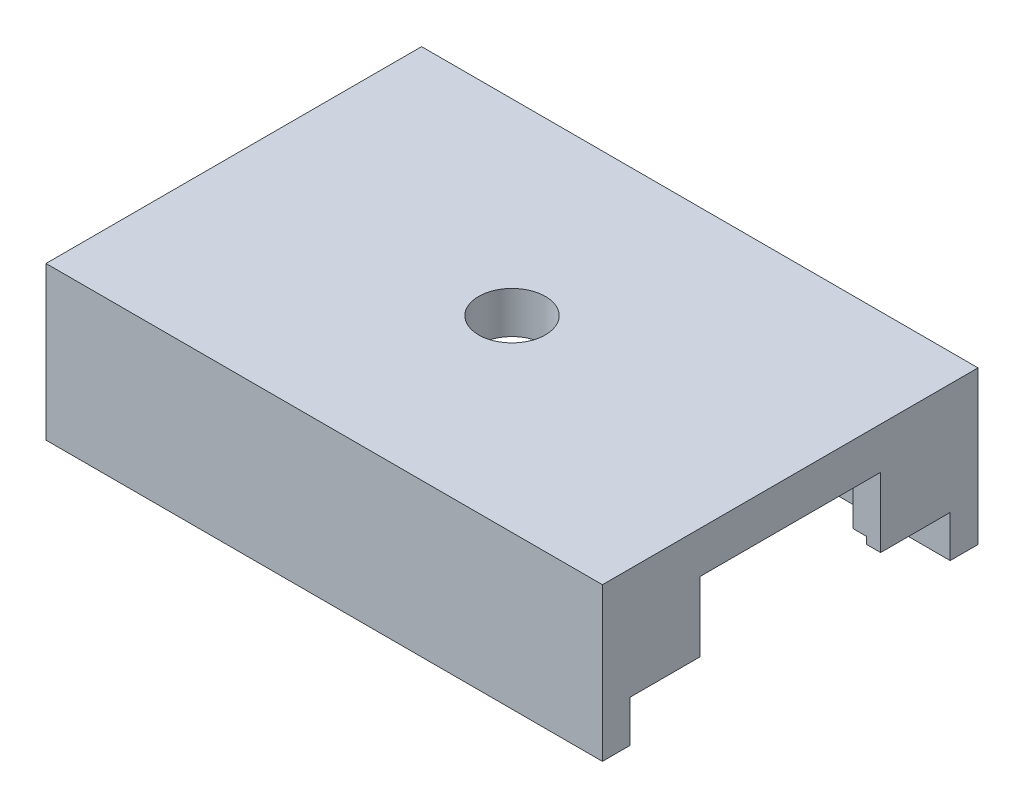
ISO-10303-21;
HEADER;
FILE_DESCRIPTION(('STEP AP214'),'2;1');
FILE_NAME('part.step','',(''),(''),'','','');
FILE_SCHEMA(('AUTOMOTIVE_DESIGN { 1 0 10303 214 1 1 1 1 }'));
ENDSEC;
DATA;
#1=APPLICATION_CONTEXT('core data for automotive mechanical design processes');
#2=APPLICATION_PROTOCOL_DEFINITION('international standard','automotive_design',2000,#1);
#3=PRODUCT_CONTEXT('',#1,'mechanical');
#4=PRODUCT('Part','Part','',(#3));
#5=PRODUCT_RELATED_PRODUCT_CATEGORY('part','',(#4));
#6=PRODUCT_DEFINITION_FORMATION('','',#4);
#7=PRODUCT_DEFINITION_CONTEXT('part definition',#1,'design');
#8=PRODUCT_DEFINITION('design','',#6,#7);
#9=PRODUCT_DEFINITION_SHAPE('','',#8);
#10=(LENGTH_UNIT() NAMED_UNIT(*) SI_UNIT(.MILLI.,.METRE.));
#11=(NAMED_UNIT(*) PLANE_ANGLE_UNIT() SI_UNIT($,.RADIAN.));
#12=(NAMED_UNIT(*) SI_UNIT($,.STERADIAN.) SOLID_ANGLE_UNIT());
#13=UNCERTAINTY_MEASURE_WITH_UNIT(LENGTH_MEASURE(1.E-05),#10,'distance_accuracy_value','');
#14=(GEOMETRIC_REPRESENTATION_CONTEXT(3) GLOBAL_UNCERTAINTY_ASSIGNED_CONTEXT((#13)) GLOBAL_UNIT_ASSIGNED_CONTEXT((#10,
#11,#12)) REPRESENTATION_CONTEXT('',''));
#15=CARTESIAN_POINT('',(0.,0.,0.));
#16=DIRECTION('',(0.,0.,1.));
#17=DIRECTION('',(1.,0.,0.));
#18=AXIS2_PLACEMENT_3D('',#15,#16,#17);
#19=CARTESIAN_POINT('',(0.,-11.,11.5));
#20=DIRECTION('',(0.,0.,-1.));
#21=DIRECTION('',(-1.,0.,0.));
#22=AXIS2_PLACEMENT_3D('',#19,#20,#21);
#23=PLANE('',#22);
#24=DIRECTION('',(-1.,0.,0.));
#25=VECTOR('',#24,1.);
#26=CARTESIAN_POINT('',(-20.,-8.,11.5));
#27=LINE('',#26,#25);
#28=CARTESIAN_POINT('',(-19.,-8.,11.5));
#29=VERTEX_POINT('',#28);
#30=CARTESIAN_POINT('',(-20.,-8.,11.5));
#31=VERTEX_POINT('',#30);
#32=EDGE_CURVE('E278',#29,#31,#27,.T.);
#33=ORIENTED_EDGE('',*,*,#32,.F.);
#34=DIRECTION('',(0.,-1.,0.));
#35=VECTOR('',#34,1.);
#36=CARTESIAN_POINT('',(-19.,0.,11.5));
#37=LINE('',#36,#35);
#38=CARTESIAN_POINT('',(-19.,-8.5,11.5));
#39=VERTEX_POINT('',#38);
#40=EDGE_CURVE('E59',#29,#39,#37,.T.);
#41=ORIENTED_EDGE('',*,*,#40,.T.);
#42=DIRECTION('',(-1.,0.,0.));
#43=VECTOR('',#42,1.);
#44=CARTESIAN_POINT('',(0.,-8.5,11.5));
#45=LINE('',#44,#43);
#46=CARTESIAN_POINT('',(19.,-8.5,11.5));
#47=VERTEX_POINT('',#46);
#48=EDGE_CURVE('E599',#47,#39,#45,.T.);
#49=ORIENTED_EDGE('',*,*,#48,.F.);
#50=DIRECTION('',(0.,-1.,0.));
#51=VECTOR('',#50,1.);
#52=CARTESIAN_POINT('',(19.,0.,11.5));
#53=LINE('',#52,#51);
#54=CARTESIAN_POINT('',(19.,-8.,11.5));
#55=VERTEX_POINT('',#54);
#56=EDGE_CURVE('E615',#55,#47,#53,.T.);
#57=ORIENTED_EDGE('',*,*,#56,.F.);
#58=DIRECTION('',(-1.,0.,0.));
#59=VECTOR('',#58,1.);
#60=CARTESIAN_POINT('',(20.,-8.,11.5));
#61=LINE('',#60,#59);
#62=CARTESIAN_POINT('',(20.,-8.,11.5));
#63=VERTEX_POINT('',#62);
#64=EDGE_CURVE('E365',#63,#55,#61,.T.);
#65=ORIENTED_EDGE('',*,*,#64,.F.);
#66=DIRECTION('',(0.,1.,0.));
#67=VECTOR('',#66,1.);
#68=CARTESIAN_POINT('',(20.,-11.,11.5));
#69=LINE('',#68,#67);
#70=CARTESIAN_POINT('',(20.,-11.,11.5));
#71=VERTEX_POINT('',#70);
#72=EDGE_CURVE('E415',#71,#63,#69,.T.);
#73=ORIENTED_EDGE('',*,*,#72,.F.);
#74=DIRECTION('',(-1.,0.,0.));
#75=VECTOR('',#74,1.);
#76=CARTESIAN_POINT('',(0.,-11.,11.5));
#77=LINE('',#76,#75);
#78=CARTESIAN_POINT('',(-20.,-11.,11.5));
#79=VERTEX_POINT('',#78);
#80=EDGE_CURVE('E389',#71,#79,#77,.T.);
#81=ORIENTED_EDGE('',*,*,#80,.T.);
#82=DIRECTION('',(0.,1.,0.));
#83=VECTOR('',#82,1.);
#84=CARTESIAN_POINT('',(-20.,-11.,11.5));
#85=LINE('',#84,#83);
#86=EDGE_CURVE('E402',#79,#31,#85,.T.);
#87=ORIENTED_EDGE('',*,*,#86,.T.);
#88=EDGE_LOOP('',(#33,#41,#49,#57,#65,#73,#81,#87));
#89=FACE_BOUND('',#88,.T.);
#90=ADVANCED_FACE('F41',(#89),#23,.T.);
#91=DIRECTION('',(0.,1.,0.));
#92=VECTOR('',#91,1.);
#93=CARTESIAN_POINT('',(18.,-8.,11.5));
#94=LINE('',#93,#92);
#95=CARTESIAN_POINT('',(18.,-7.5,11.5));
#96=VERTEX_POINT('',#95);
#97=CARTESIAN_POINT('',(18.,-3.,11.5));
#98=VERTEX_POINT('',#97);
#99=EDGE_CURVE('E385',#96,#98,#94,.T.);
#100=ORIENTED_EDGE('',*,*,#99,.F.);
#101=DIRECTION('',(-1.,0.,0.));
#102=VECTOR('',#101,1.);
#103=CARTESIAN_POINT('',(0.,-7.5,11.5));
#104=LINE('',#103,#102);
#105=CARTESIAN_POINT('',(-18.,-7.5,11.5));
#106=VERTEX_POINT('',#105);
#107=EDGE_CURVE('E575',#96,#106,#104,.T.);
#108=ORIENTED_EDGE('',*,*,#107,.T.);
#109=DIRECTION('',(0.,1.,0.));
#110=VECTOR('',#109,1.);
#111=CARTESIAN_POINT('',(-18.,-8.,11.5));
#112=LINE('',#111,#110);
#113=CARTESIAN_POINT('',(-18.,-3.,11.5));
#114=VERTEX_POINT('',#113);
#115=EDGE_CURVE('E282',#106,#114,#112,.T.);
#116=ORIENTED_EDGE('',*,*,#115,.T.);
#117=DIRECTION('',(-1.,0.,0.));
#118=VECTOR('',#117,1.);
#119=CARTESIAN_POINT('',(0.,-3.,11.5));
#120=LINE('',#119,#118);
#121=EDGE_CURVE('E388',#98,#114,#120,.T.);
#122=ORIENTED_EDGE('',*,*,#121,.F.);
#123=EDGE_LOOP('',(#100,#108,#116,#122));
#124=FACE_BOUND('',#123,.T.);
#125=ADVANCED_FACE('F488',(#124),#23,.T.);
#126=CARTESIAN_POINT('',(18.,-8.,11.5));
#127=DIRECTION('',(1.,0.,0.));
#128=DIRECTION('',(0.,0.,-1.));
#129=AXIS2_PLACEMENT_3D('',#126,#127,#128);
#130=PLANE('',#129);
#131=DIRECTION('',(0.,0.,-1.));
#132=VECTOR('',#131,1.);
#133=CARTESIAN_POINT('',(18.,-7.5,-13.501));
#134=LINE('',#133,#132);
#135=CARTESIAN_POINT('',(18.,-7.5,6.5));
#136=VERTEX_POINT('',#135);
#137=EDGE_CURVE('E573',#96,#136,#134,.T.);
#138=ORIENTED_EDGE('',*,*,#137,.F.);
#139=ORIENTED_EDGE('',*,*,#99,.T.);
#140=DIRECTION('',(0.,0.,-1.));
#141=VECTOR('',#140,1.);
#142=CARTESIAN_POINT('',(18.,-3.,11.5));
#143=LINE('',#142,#141);
#144=CARTESIAN_POINT('',(18.,-3.,6.5));
#145=VERTEX_POINT('',#144);
#146=EDGE_CURVE('E361',#98,#145,#143,.T.);
#147=ORIENTED_EDGE('',*,*,#146,.T.);
#148=DIRECTION('',(0.,1.,0.));
#149=VECTOR('',#148,1.);
#150=CARTESIAN_POINT('',(18.,-8.,6.5));
#151=LINE('',#150,#149);
#152=EDGE_CURVE('E382',#136,#145,#151,.T.);
#153=ORIENTED_EDGE('',*,*,#152,.F.);
#154=EDGE_LOOP('',(#138,#139,#147,#153));
#155=FACE_BOUND('',#154,.T.);
#156=ADVANCED_FACE('F494',(#155),#130,.F.);
#157=CARTESIAN_POINT('',(-20.,-8.,6.5));
#158=DIRECTION('',(0.,0.,1.));
#159=DIRECTION('',(1.,0.,0.));
#160=AXIS2_PLACEMENT_3D('',#157,#158,#159);
#161=PLANE('',#160);
#162=DIRECTION('',(0.,1.,0.));
#163=VECTOR('',#162,1.);
#164=CARTESIAN_POINT('',(-19.,0.,6.5));
#165=LINE('',#164,#163);
#166=CARTESIAN_POINT('',(-19.,-8.,6.5));
#167=VERTEX_POINT('',#166);
#168=CARTESIAN_POINT('',(-19.,-7.5,6.5));
#169=VERTEX_POINT('',#168);
#170=EDGE_CURVE('E255',#167,#169,#165,.T.);
#171=ORIENTED_EDGE('',*,*,#170,.F.);
#172=DIRECTION('',(1.,0.,0.));
#173=VECTOR('',#172,1.);
#174=CARTESIAN_POINT('',(-20.,-8.,6.5));
#175=LINE('',#174,#173);
#176=CARTESIAN_POINT('',(-20.,-8.,6.5));
#177=VERTEX_POINT('',#176);
#178=EDGE_CURVE('E267',#177,#167,#175,.T.);
#179=ORIENTED_EDGE('',*,*,#178,.F.);
#180=DIRECTION('',(0.,1.,0.));
#181=VECTOR('',#180,1.);
#182=CARTESIAN_POINT('',(-20.,-8.,6.5));
#183=LINE('',#182,#181);
#184=CARTESIAN_POINT('',(-20.,-3.,6.5));
#185=VERTEX_POINT('',#184);
#186=EDGE_CURVE('E301',#177,#185,#183,.T.);
#187=ORIENTED_EDGE('',*,*,#186,.T.);
#188=DIRECTION('',(1.,0.,0.));
#189=VECTOR('',#188,1.);
#190=CARTESIAN_POINT('',(-20.,-3.,6.5));
#191=LINE('',#190,#189);
#192=CARTESIAN_POINT('',(-18.,-3.,6.5));
#193=VERTEX_POINT('',#192);
#194=EDGE_CURVE('E288',#185,#193,#191,.T.);
#195=ORIENTED_EDGE('',*,*,#194,.T.);
#196=DIRECTION('',(0.,1.,0.));
#197=VECTOR('',#196,1.);
#198=CARTESIAN_POINT('',(-18.,-8.,6.5));
#199=LINE('',#198,#197);
#200=CARTESIAN_POINT('',(-18.,-7.5,6.5));
#201=VERTEX_POINT('',#200);
#202=EDGE_CURVE('E298',#201,#193,#199,.T.);
#203=ORIENTED_EDGE('',*,*,#202,.F.);
#204=DIRECTION('',(1.,0.,0.));
#205=VECTOR('',#204,1.);
#206=CARTESIAN_POINT('',(0.,-7.5,6.49999999999999));
#207=LINE('',#206,#205);
#208=EDGE_CURVE('E262',#169,#201,#207,.T.);
#209=ORIENTED_EDGE('',*,*,#208,.F.);
#210=EDGE_LOOP('',(#171,#179,#187,#195,#203,#209));
#211=FACE_BOUND('',#210,.T.);
#212=ADVANCED_FACE('F265',(#211),#161,.F.);
#213=CARTESIAN_POINT('',(-18.,-8.,11.5));
#214=DIRECTION('',(-1.,0.,0.));
#215=DIRECTION('',(0.,0.,1.));
#216=AXIS2_PLACEMENT_3D('',#213,#214,#215);
#217=PLANE('',#216);
#218=DIRECTION('',(0.,0.,1.));
#219=VECTOR('',#218,1.);
#220=CARTESIAN_POINT('',(-18.,-7.5,-13.501));
#221=LINE('',#220,#219);
#222=EDGE_CURVE('E271',#201,#106,#221,.T.);
#223=ORIENTED_EDGE('',*,*,#222,.F.);
#224=ORIENTED_EDGE('',*,*,#202,.T.);
#225=DIRECTION('',(0.,0.,1.));
#226=VECTOR('',#225,1.);
#227=CARTESIAN_POINT('',(-18.,-3.,11.5));
#228=LINE('',#227,#226);
#229=EDGE_CURVE('E284',#193,#114,#228,.T.);
#230=ORIENTED_EDGE('',*,*,#229,.T.);
#231=ORIENTED_EDGE('',*,*,#115,.F.);
#232=EDGE_LOOP('',(#223,#224,#230,#231));
#233=FACE_BOUND('',#232,.T.);
#234=ADVANCED_FACE('F579',(#233),#217,.F.);
#235=CARTESIAN_POINT('',(0.,-8.,0.));
#236=DIRECTION('',(0.,-1.,0.));
#237=DIRECTION('',(0.,0.,-1.));
#238=AXIS2_PLACEMENT_3D('',#235,#236,#237);
#239=PLANE('',#238);
#240=ORIENTED_EDGE('',*,*,#178,.T.);
#241=DIRECTION('',(0.,0.,1.));
#242=VECTOR('',#241,1.);
#243=CARTESIAN_POINT('',(-19.,-8.,-13.501));
#244=LINE('',#243,#242);
#245=EDGE_CURVE('E251',#167,#29,#244,.T.);
#246=ORIENTED_EDGE('',*,*,#245,.T.);
#247=ORIENTED_EDGE('',*,*,#32,.T.);
#248=DIRECTION('',(0.,0.,-1.));
#249=VECTOR('',#248,1.);
#250=CARTESIAN_POINT('',(-20.,-8.,11.5));
#251=LINE('',#250,#249);
#252=EDGE_CURVE('E275',#31,#177,#251,.T.);
#253=ORIENTED_EDGE('',*,*,#252,.T.);
#254=EDGE_LOOP('',(#240,#246,#247,#253));
#255=FACE_BOUND('',#254,.T.);
#256=ADVANCED_FACE('F273',(#255),#239,.T.);
#257=CARTESIAN_POINT('',(0.,-11.,-11.5));
#258=DIRECTION('',(0.,0.,-1.));
#259=DIRECTION('',(-1.,0.,0.));
#260=AXIS2_PLACEMENT_3D('',#257,#258,#259);
#261=PLANE('',#260);
#262=DIRECTION('',(0.,1.,0.));
#263=VECTOR('',#262,1.);
#264=CARTESIAN_POINT('',(-18.,-8.,-11.5));
#265=LINE('',#264,#263);
#266=CARTESIAN_POINT('',(-18.,-7.5,-11.5));
#267=VERTEX_POINT('',#266);
#268=CARTESIAN_POINT('',(-18.,-3.,-11.5));
#269=VERTEX_POINT('',#268);
#270=EDGE_CURVE('E330',#267,#269,#265,.T.);
#271=ORIENTED_EDGE('',*,*,#270,.F.);
#272=DIRECTION('',(-1.,0.,0.));
#273=VECTOR('',#272,1.);
#274=CARTESIAN_POINT('',(0.,-7.5,-11.5));
#275=LINE('',#274,#273);
#276=CARTESIAN_POINT('',(18.,-7.5,-11.5));
#277=VERTEX_POINT('',#276);
#278=EDGE_CURVE('E539',#277,#267,#275,.T.);
#279=ORIENTED_EDGE('',*,*,#278,.F.);
#280=DIRECTION('',(0.,1.,0.));
#281=VECTOR('',#280,1.);
#282=CARTESIAN_POINT('',(18.,-8.,-11.5));
#283=LINE('',#282,#281);
#284=CARTESIAN_POINT('',(18.,-3.,-11.5));
#285=VERTEX_POINT('',#284);
#286=EDGE_CURVE('E346',#277,#285,#283,.T.);
#287=ORIENTED_EDGE('',*,*,#286,.T.);
#288=DIRECTION('',(-1.,0.,0.));
#289=VECTOR('',#288,1.);
#290=CARTESIAN_POINT('',(0.,-3.,-11.5));
#291=LINE('',#290,#289);
#292=EDGE_CURVE('E419',#285,#269,#291,.T.);
#293=ORIENTED_EDGE('',*,*,#292,.T.);
#294=EDGE_LOOP('',(#271,#279,#287,#293));
#295=FACE_BOUND('',#294,.T.);
#296=ADVANCED_FACE('F507',(#295),#261,.F.);
#297=CARTESIAN_POINT('',(0.,-8.,0.));
#298=DIRECTION('',(0.,-1.,0.));
#299=DIRECTION('',(0.,0.,-1.));
#300=AXIS2_PLACEMENT_3D('',#297,#298,#299);
#301=PLANE('',#300);
#302=DIRECTION('',(-1.,0.,0.));
#303=VECTOR('',#302,1.);
#304=CARTESIAN_POINT('',(20.,-8.,-6.5));
#305=LINE('',#304,#303);
#306=CARTESIAN_POINT('',(20.,-8.,-6.5));
#307=VERTEX_POINT('',#306);
#308=CARTESIAN_POINT('',(19.,-8.,-6.5));
#309=VERTEX_POINT('',#308);
#310=EDGE_CURVE('E338',#307,#309,#305,.T.);
#311=ORIENTED_EDGE('',*,*,#310,.T.);
#312=DIRECTION('',(0.,0.,-1.));
#313=VECTOR('',#312,1.);
#314=CARTESIAN_POINT('',(19.,-8.,13.501));
#315=LINE('',#314,#313);
#316=CARTESIAN_POINT('',(19.,-8.,-11.5));
#317=VERTEX_POINT('',#316);
#318=EDGE_CURVE('E639',#309,#317,#315,.T.);
#319=ORIENTED_EDGE('',*,*,#318,.T.);
#320=DIRECTION('',(1.,0.,0.));
#321=VECTOR('',#320,1.);
#322=CARTESIAN_POINT('',(20.,-8.,-11.5));
#323=LINE('',#322,#321);
#324=CARTESIAN_POINT('',(20.,-8.,-11.5));
#325=VERTEX_POINT('',#324);
#326=EDGE_CURVE('E343',#317,#325,#323,.T.);
#327=ORIENTED_EDGE('',*,*,#326,.T.);
#328=DIRECTION('',(0.,0.,1.));
#329=VECTOR('',#328,1.);
#330=CARTESIAN_POINT('',(20.,-8.,-11.5));
#331=LINE('',#330,#329);
#332=EDGE_CURVE('E334',#325,#307,#331,.T.);
#333=ORIENTED_EDGE('',*,*,#332,.T.);
#334=EDGE_LOOP('',(#311,#319,#327,#333));
#335=FACE_BOUND('',#334,.T.);
#336=ADVANCED_FACE('F509',(#335),#301,.T.);
#337=CARTESIAN_POINT('',(0.,-3.,0.));
#338=DIRECTION('',(0.,1.,0.));
#339=DIRECTION('',(0.,0.,1.));
#340=AXIS2_PLACEMENT_3D('',#337,#338,#339);
#341=PLANE('',#340);
#342=CARTESIAN_POINT('',(0.,-3.,0.));
#343=DIRECTION('',(0.,1.,0.));
#344=DIRECTION('',(0.,0.,1.));
#345=AXIS2_PLACEMENT_3D('',#342,#343,#344);
#346=CIRCLE('',#345,2.4);
#347=CARTESIAN_POINT('',(0.,-3.,2.4));
#348=VERTEX_POINT('',#347);
#349=EDGE_CURVE('E11',#348,#348,#346,.T.);
#350=ORIENTED_EDGE('',*,*,#349,.T.);
#351=EDGE_LOOP('',(#350));
#352=FACE_BOUND('',#351,.T.);
#353=ORIENTED_EDGE('',*,*,#194,.F.);
#354=DIRECTION('',(0.,0.,-1.));
#355=VECTOR('',#354,1.);
#356=CARTESIAN_POINT('',(-20.,-3.,0.));
#357=LINE('',#356,#355);
#358=CARTESIAN_POINT('',(-20.,-3.,-6.5));
#359=VERTEX_POINT('',#358);
#360=EDGE_CURVE('E451',#185,#359,#357,.T.);
#361=ORIENTED_EDGE('',*,*,#360,.T.);
#362=DIRECTION('',(-1.,0.,0.));
#363=VECTOR('',#362,1.);
#364=CARTESIAN_POINT('',(-20.,-3.,-6.5));
#365=LINE('',#364,#363);
#366=CARTESIAN_POINT('',(-18.,-3.,-6.5));
#367=VERTEX_POINT('',#366);
#368=EDGE_CURVE('E310',#367,#359,#365,.T.);
#369=ORIENTED_EDGE('',*,*,#368,.F.);
#370=DIRECTION('',(0.,0.,1.));
#371=VECTOR('',#370,1.);
#372=CARTESIAN_POINT('',(-18.,-3.,-11.5));
#373=LINE('',#372,#371);
#374=EDGE_CURVE('E304',#269,#367,#373,.T.);
#375=ORIENTED_EDGE('',*,*,#374,.F.);
#376=ORIENTED_EDGE('',*,*,#292,.F.);
#377=DIRECTION('',(0.,0.,-1.));
#378=VECTOR('',#377,1.);
#379=CARTESIAN_POINT('',(18.,-3.,-11.5));
#380=LINE('',#379,#378);
#381=CARTESIAN_POINT('',(18.,-3.,-6.5));
#382=VERTEX_POINT('',#381);
#383=EDGE_CURVE('E339',#382,#285,#380,.T.);
#384=ORIENTED_EDGE('',*,*,#383,.F.);
#385=DIRECTION('',(-1.,0.,0.));
#386=VECTOR('',#385,1.);
#387=CARTESIAN_POINT('',(20.,-3.,-6.5));
#388=LINE('',#387,#386);
#389=CARTESIAN_POINT('',(20.,-3.,-6.5));
#390=VERTEX_POINT('',#389);
#391=EDGE_CURVE('E333',#390,#382,#388,.T.);
#392=ORIENTED_EDGE('',*,*,#391,.F.);
#393=DIRECTION('',(0.,0.,-1.));
#394=VECTOR('',#393,1.);
#395=CARTESIAN_POINT('',(20.,-3.,0.));
#396=LINE('',#395,#394);
#397=CARTESIAN_POINT('',(20.,-3.,6.5));
#398=VERTEX_POINT('',#397);
#399=EDGE_CURVE('E51',#398,#390,#396,.T.);
#400=ORIENTED_EDGE('',*,*,#399,.F.);
#401=DIRECTION('',(1.,0.,0.));
#402=VECTOR('',#401,1.);
#403=CARTESIAN_POINT('',(20.,-3.,6.5));
#404=LINE('',#403,#402);
#405=EDGE_CURVE('E366',#145,#398,#404,.T.);
#406=ORIENTED_EDGE('',*,*,#405,.F.);
#407=ORIENTED_EDGE('',*,*,#146,.F.);
#408=ORIENTED_EDGE('',*,*,#121,.T.);
#409=ORIENTED_EDGE('',*,*,#229,.F.);
#410=EDGE_LOOP('',(#353,#361,#369,#375,#376,#384,#392,#400,#406,#407,#408,#409));
#411=FACE_BOUND('',#410,.T.);
#412=ADVANCED_FACE('F505',(#352,#411),#341,.F.);
#413=DIRECTION('',(-1.,0.,0.));
#414=VECTOR('',#413,1.);
#415=CARTESIAN_POINT('',(0.,-8.5,-11.5));
#416=LINE('',#415,#414);
#417=CARTESIAN_POINT('',(19.,-8.5,-11.5));
#418=VERTEX_POINT('',#417);
#419=CARTESIAN_POINT('',(-19.,-8.5,-11.5));
#420=VERTEX_POINT('',#419);
#421=EDGE_CURVE('E674',#418,#420,#416,.T.);
#422=ORIENTED_EDGE('',*,*,#421,.T.);
#423=DIRECTION('',(0.,-1.,0.));
#424=VECTOR('',#423,1.);
#425=CARTESIAN_POINT('',(-19.,0.,-11.5));
#426=LINE('',#425,#424);
#427=CARTESIAN_POINT('',(-19.,-8.,-11.5));
#428=VERTEX_POINT('',#427);
#429=EDGE_CURVE('E656',#428,#420,#426,.T.);
#430=ORIENTED_EDGE('',*,*,#429,.F.);
#431=DIRECTION('',(1.,0.,0.));
#432=VECTOR('',#431,1.);
#433=CARTESIAN_POINT('',(-20.,-8.,-11.5));
#434=LINE('',#433,#432);
#435=CARTESIAN_POINT('',(-20.,-8.,-11.5));
#436=VERTEX_POINT('',#435);
#437=EDGE_CURVE('E305',#436,#428,#434,.T.);
#438=ORIENTED_EDGE('',*,*,#437,.F.);
#439=DIRECTION('',(0.,1.,0.));
#440=VECTOR('',#439,1.);
#441=CARTESIAN_POINT('',(-20.,-11.,-11.5));
#442=LINE('',#441,#440);
#443=CARTESIAN_POINT('',(-20.,-11.,-11.5));
#444=VERTEX_POINT('',#443);
#445=EDGE_CURVE('E439',#444,#436,#442,.T.);
#446=ORIENTED_EDGE('',*,*,#445,.F.);
#447=DIRECTION('',(-1.,0.,0.));
#448=VECTOR('',#447,1.);
#449=CARTESIAN_POINT('',(0.,-11.,-11.5));
#450=LINE('',#449,#448);
#451=CARTESIAN_POINT('',(20.,-11.,-11.5));
#452=VERTEX_POINT('',#451);
#453=EDGE_CURVE('E427',#452,#444,#450,.T.);
#454=ORIENTED_EDGE('',*,*,#453,.F.);
#455=DIRECTION('',(0.,1.,0.));
#456=VECTOR('',#455,1.);
#457=CARTESIAN_POINT('',(20.,-11.,-11.5));
#458=LINE('',#457,#456);
#459=EDGE_CURVE('E443',#452,#325,#458,.T.);
#460=ORIENTED_EDGE('',*,*,#459,.T.);
#461=ORIENTED_EDGE('',*,*,#326,.F.);
#462=DIRECTION('',(0.,-1.,0.));
#463=VECTOR('',#462,1.);
#464=CARTESIAN_POINT('',(19.,0.,-11.5));
#465=LINE('',#464,#463);
#466=EDGE_CURVE('E678',#317,#418,#465,.T.);
#467=ORIENTED_EDGE('',*,*,#466,.T.);
#468=EDGE_LOOP('',(#422,#430,#438,#446,#454,#460,#461,#467));
#469=FACE_BOUND('',#468,.T.);
#470=ADVANCED_FACE('F503',(#469),#261,.F.);
#471=CARTESIAN_POINT('',(-20.,-3.,0.));
#472=DIRECTION('',(1.,0.,0.));
#473=DIRECTION('',(0.,0.,-1.));
#474=AXIS2_PLACEMENT_3D('',#471,#472,#473);
#475=PLANE('',#474);
#476=DIRECTION('',(0.,0.,-1.));
#477=VECTOR('',#476,1.);
#478=CARTESIAN_POINT('',(-20.,0.,0.));
#479=LINE('',#478,#477);
#480=CARTESIAN_POINT('',(-20.,0.,13.5));
#481=VERTEX_POINT('',#480);
#482=CARTESIAN_POINT('',(-20.,0.,-13.5));
#483=VERTEX_POINT('',#482);
#484=EDGE_CURVE('E450',#481,#483,#479,.T.);
#485=ORIENTED_EDGE('',*,*,#484,.T.);
#486=DIRECTION('',(0.,1.,0.));
#487=VECTOR('',#486,1.);
#488=CARTESIAN_POINT('',(-20.,-11.,-13.5));
#489=LINE('',#488,#487);
#490=CARTESIAN_POINT('',(-20.,-11.,-13.5));
#491=VERTEX_POINT('',#490);
#492=EDGE_CURVE('E433',#491,#483,#489,.T.);
#493=ORIENTED_EDGE('',*,*,#492,.F.);
#494=DIRECTION('',(0.,0.,-1.));
#495=VECTOR('',#494,1.);
#496=CARTESIAN_POINT('',(-20.,-11.,0.));
#497=LINE('',#496,#495);
#498=EDGE_CURVE('E430',#444,#491,#497,.T.);
#499=ORIENTED_EDGE('',*,*,#498,.F.);
#500=ORIENTED_EDGE('',*,*,#445,.T.);
#501=DIRECTION('',(0.,0.,-1.));
#502=VECTOR('',#501,1.);
#503=CARTESIAN_POINT('',(-20.,-8.,-11.5));
#504=LINE('',#503,#502);
#505=CARTESIAN_POINT('',(-20.,-8.,-6.5));
#506=VERTEX_POINT('',#505);
#507=EDGE_CURVE('E313',#506,#436,#504,.T.);
#508=ORIENTED_EDGE('',*,*,#507,.F.);
#509=DIRECTION('',(0.,1.,0.));
#510=VECTOR('',#509,1.);
#511=CARTESIAN_POINT('',(-20.,-8.,-6.5));
#512=LINE('',#511,#510);
#513=EDGE_CURVE('E317',#506,#359,#512,.T.);
#514=ORIENTED_EDGE('',*,*,#513,.T.);
#515=ORIENTED_EDGE('',*,*,#360,.F.);
#516=ORIENTED_EDGE('',*,*,#186,.F.);
#517=ORIENTED_EDGE('',*,*,#252,.F.);
#518=ORIENTED_EDGE('',*,*,#86,.F.);
#519=DIRECTION('',(0.,0.,-1.));
#520=VECTOR('',#519,1.);
#521=CARTESIAN_POINT('',(-20.,-11.,0.));
#522=LINE('',#521,#520);
#523=CARTESIAN_POINT('',(-20.,-11.,13.5));
#524=VERTEX_POINT('',#523);
#525=EDGE_CURVE('E399',#524,#79,#522,.T.);
#526=ORIENTED_EDGE('',*,*,#525,.F.);
#527=DIRECTION('',(0.,1.,0.));
#528=VECTOR('',#527,1.);
#529=CARTESIAN_POINT('',(-20.,-11.,13.5));
#530=LINE('',#529,#528);
#531=EDGE_CURVE('E409',#524,#481,#530,.T.);
#532=ORIENTED_EDGE('',*,*,#531,.T.);
#533=EDGE_LOOP('',(#485,#493,#499,#500,#508,#514,#515,#516,#517,#518,#526,#532));
#534=FACE_BOUND('',#533,.T.);
#535=ADVANCED_FACE('F43',(#534),#475,.F.);
#536=CARTESIAN_POINT('',(20.,-3.,0.));
#537=DIRECTION('',(1.,0.,0.));
#538=DIRECTION('',(0.,0.,-1.));
#539=AXIS2_PLACEMENT_3D('',#536,#537,#538);
#540=PLANE('',#539);
#541=DIRECTION('',(0.,1.,0.));
#542=VECTOR('',#541,1.);
#543=CARTESIAN_POINT('',(20.,-11.,-13.5));
#544=LINE('',#543,#542);
#545=CARTESIAN_POINT('',(20.,-11.,-13.5));
#546=VERTEX_POINT('',#545);
#547=CARTESIAN_POINT('',(20.,0.,-13.5));
#548=VERTEX_POINT('',#547);
#549=EDGE_CURVE('E447',#546,#548,#544,.T.);
#550=ORIENTED_EDGE('',*,*,#549,.T.);
#551=DIRECTION('',(0.,0.,-1.));
#552=VECTOR('',#551,1.);
#553=CARTESIAN_POINT('',(20.,0.,0.));
#554=LINE('',#553,#552);
#555=CARTESIAN_POINT('',(20.,0.,13.5));
#556=VERTEX_POINT('',#555);
#557=EDGE_CURVE('E459',#556,#548,#554,.T.);
#558=ORIENTED_EDGE('',*,*,#557,.F.);
#559=DIRECTION('',(0.,1.,0.));
#560=VECTOR('',#559,1.);
#561=CARTESIAN_POINT('',(20.,-11.,13.5));
#562=LINE('',#561,#560);
#563=CARTESIAN_POINT('',(20.,-11.,13.5));
#564=VERTEX_POINT('',#563);
#565=EDGE_CURVE('E412',#564,#556,#562,.T.);
#566=ORIENTED_EDGE('',*,*,#565,.F.);
#567=DIRECTION('',(0.,0.,1.));
#568=VECTOR('',#567,1.);
#569=CARTESIAN_POINT('',(20.,-11.,0.));
#570=LINE('',#569,#568);
#571=EDGE_CURVE('E393',#71,#564,#570,.T.);
#572=ORIENTED_EDGE('',*,*,#571,.F.);
#573=ORIENTED_EDGE('',*,*,#72,.T.);
#574=DIRECTION('',(0.,0.,1.));
#575=VECTOR('',#574,1.);
#576=CARTESIAN_POINT('',(20.,-8.,11.5));
#577=LINE('',#576,#575);
#578=CARTESIAN_POINT('',(20.,-8.,6.5));
#579=VERTEX_POINT('',#578);
#580=EDGE_CURVE('E362',#579,#63,#577,.T.);
#581=ORIENTED_EDGE('',*,*,#580,.F.);
#582=DIRECTION('',(0.,1.,0.));
#583=VECTOR('',#582,1.);
#584=CARTESIAN_POINT('',(20.,-8.,6.5));
#585=LINE('',#584,#583);
#586=EDGE_CURVE('E373',#579,#398,#585,.T.);
#587=ORIENTED_EDGE('',*,*,#586,.T.);
#588=ORIENTED_EDGE('',*,*,#399,.T.);
#589=DIRECTION('',(0.,1.,0.));
#590=VECTOR('',#589,1.);
#591=CARTESIAN_POINT('',(20.,-8.,-6.5));
#592=LINE('',#591,#590);
#593=EDGE_CURVE('E358',#307,#390,#592,.T.);
#594=ORIENTED_EDGE('',*,*,#593,.F.);
#595=ORIENTED_EDGE('',*,*,#332,.F.);
#596=ORIENTED_EDGE('',*,*,#459,.F.);
#597=DIRECTION('',(0.,0.,1.));
#598=VECTOR('',#597,1.);
#599=CARTESIAN_POINT('',(20.,-11.,0.));
#600=LINE('',#599,#598);
#601=EDGE_CURVE('E424',#546,#452,#600,.T.);
#602=ORIENTED_EDGE('',*,*,#601,.F.);
#603=EDGE_LOOP('',(#550,#558,#566,#572,#573,#581,#587,#588,#594,#595,#596,#602));
#604=FACE_BOUND('',#603,.T.);
#605=ADVANCED_FACE('F483',(#604),#540,.T.);
#606=CARTESIAN_POINT('',(0.,-3.,0.));
#607=DIRECTION('',(0.,1.,0.));
#608=DIRECTION('',(0.,0.,1.));
#609=AXIS2_PLACEMENT_3D('',#606,#607,#608);
#610=CYLINDRICAL_SURFACE('',#609,2.4);
#611=ORIENTED_EDGE('',*,*,#349,.F.);
#612=EDGE_LOOP('',(#611));
#613=FACE_BOUND('',#612,.T.);
#614=CARTESIAN_POINT('',(0.,0.,0.));
#615=DIRECTION('',(0.,1.,0.));
#616=DIRECTION('',(0.,0.,1.));
#617=AXIS2_PLACEMENT_3D('',#614,#615,#616);
#618=CIRCLE('',#617,2.4);
#619=CARTESIAN_POINT('',(0.,0.,2.4));
#620=VERTEX_POINT('',#619);
#621=EDGE_CURVE('E45',#620,#620,#618,.T.);
#622=ORIENTED_EDGE('',*,*,#621,.T.);
#623=EDGE_LOOP('',(#622));
#624=FACE_BOUND('',#623,.T.);
#625=ADVANCED_FACE('F470',(#613,#624),#610,.F.);
#626=CARTESIAN_POINT('',(0.,0.,0.));
#627=DIRECTION('',(0.,1.,0.));
#628=DIRECTION('',(0.,0.,1.));
#629=AXIS2_PLACEMENT_3D('',#626,#627,#628);
#630=PLANE('',#629);
#631=DIRECTION('',(-1.,0.,0.));
#632=VECTOR('',#631,1.);
#633=CARTESIAN_POINT('',(20.,0.,-13.5));
#634=LINE('',#633,#632);
#635=EDGE_CURVE('E687',#548,#483,#634,.T.);
#636=ORIENTED_EDGE('',*,*,#635,.T.);
#637=ORIENTED_EDGE('',*,*,#484,.F.);
#638=DIRECTION('',(1.,0.,0.));
#639=VECTOR('',#638,1.);
#640=CARTESIAN_POINT('',(20.,0.,13.5));
#641=LINE('',#640,#639);
#642=EDGE_CURVE('E292',#481,#556,#641,.T.);
#643=ORIENTED_EDGE('',*,*,#642,.T.);
#644=ORIENTED_EDGE('',*,*,#557,.T.);
#645=EDGE_LOOP('',(#636,#637,#643,#644));
#646=FACE_BOUND('',#645,.T.);
#647=ORIENTED_EDGE('',*,*,#621,.F.);
#648=EDGE_LOOP('',(#647));
#649=FACE_BOUND('',#648,.T.);
#650=ADVANCED_FACE('F472',(#646,#649),#630,.T.);
#651=CARTESIAN_POINT('',(0.,-11.,-13.5));
#652=DIRECTION('',(0.,0.,-1.));
#653=DIRECTION('',(-1.,0.,0.));
#654=AXIS2_PLACEMENT_3D('',#651,#652,#653);
#655=PLANE('',#654);
#656=ORIENTED_EDGE('',*,*,#492,.T.);
#657=ORIENTED_EDGE('',*,*,#635,.F.);
#658=ORIENTED_EDGE('',*,*,#549,.F.);
#659=DIRECTION('',(-1.,0.,0.));
#660=VECTOR('',#659,1.);
#661=CARTESIAN_POINT('',(0.,-11.,-13.5));
#662=LINE('',#661,#660);
#663=EDGE_CURVE('E420',#546,#491,#662,.T.);
#664=ORIENTED_EDGE('',*,*,#663,.T.);
#665=EDGE_LOOP('',(#656,#657,#658,#664));
#666=FACE_BOUND('',#665,.T.);
#667=ADVANCED_FACE('F474',(#666),#655,.T.);
#668=CARTESIAN_POINT('',(0.,-11.,0.));
#669=DIRECTION('',(0.,-1.,0.));
#670=DIRECTION('',(0.,0.,-1.));
#671=AXIS2_PLACEMENT_3D('',#668,#669,#670);
#672=PLANE('',#671);
#673=ORIENTED_EDGE('',*,*,#663,.F.);
#674=ORIENTED_EDGE('',*,*,#601,.T.);
#675=ORIENTED_EDGE('',*,*,#453,.T.);
#676=ORIENTED_EDGE('',*,*,#498,.T.);
#677=EDGE_LOOP('',(#673,#674,#675,#676));
#678=FACE_BOUND('',#677,.T.);
#679=ADVANCED_FACE('F480',(#678),#672,.T.);
#680=CARTESIAN_POINT('',(0.,-11.,13.5));
#681=DIRECTION('',(0.,0.,-1.));
#682=DIRECTION('',(-1.,0.,0.));
#683=AXIS2_PLACEMENT_3D('',#680,#681,#682);
#684=PLANE('',#683);
#685=ORIENTED_EDGE('',*,*,#565,.T.);
#686=ORIENTED_EDGE('',*,*,#642,.F.);
#687=ORIENTED_EDGE('',*,*,#531,.F.);
#688=DIRECTION('',(-1.,0.,0.));
#689=VECTOR('',#688,1.);
#690=CARTESIAN_POINT('',(0.,-11.,13.5));
#691=LINE('',#690,#689);
#692=EDGE_CURVE('E396',#564,#524,#691,.T.);
#693=ORIENTED_EDGE('',*,*,#692,.F.);
#694=EDGE_LOOP('',(#685,#686,#687,#693));
#695=FACE_BOUND('',#694,.T.);
#696=ADVANCED_FACE('F498',(#695),#684,.F.);
#697=CARTESIAN_POINT('',(0.,-11.,0.));
#698=DIRECTION('',(0.,-1.,0.));
#699=DIRECTION('',(0.,0.,-1.));
#700=AXIS2_PLACEMENT_3D('',#697,#698,#699);
#701=PLANE('',#700);
#702=ORIENTED_EDGE('',*,*,#80,.F.);
#703=ORIENTED_EDGE('',*,*,#571,.T.);
#704=ORIENTED_EDGE('',*,*,#692,.T.);
#705=ORIENTED_EDGE('',*,*,#525,.T.);
#706=EDGE_LOOP('',(#702,#703,#704,#705));
#707=FACE_BOUND('',#706,.T.);
#708=ADVANCED_FACE('F714',(#707),#701,.T.);
#709=CARTESIAN_POINT('',(20.,-8.,6.5));
#710=DIRECTION('',(0.,0.,1.));
#711=DIRECTION('',(1.,0.,0.));
#712=AXIS2_PLACEMENT_3D('',#709,#710,#711);
#713=PLANE('',#712);
#714=DIRECTION('',(1.,0.,0.));
#715=VECTOR('',#714,1.);
#716=CARTESIAN_POINT('',(20.,-8.,6.5));
#717=LINE('',#716,#715);
#718=CARTESIAN_POINT('',(19.,-8.,6.5));
#719=VERTEX_POINT('',#718);
#720=EDGE_CURVE('E370',#719,#579,#717,.T.);
#721=ORIENTED_EDGE('',*,*,#720,.F.);
#722=DIRECTION('',(0.,1.,0.));
#723=VECTOR('',#722,1.);
#724=CARTESIAN_POINT('',(19.,0.,6.5));
#725=LINE('',#724,#723);
#726=CARTESIAN_POINT('',(19.,-7.5,6.5));
#727=VERTEX_POINT('',#726);
#728=EDGE_CURVE('E585',#719,#727,#725,.T.);
#729=ORIENTED_EDGE('',*,*,#728,.T.);
#730=DIRECTION('',(1.,0.,0.));
#731=VECTOR('',#730,1.);
#732=CARTESIAN_POINT('',(0.,-7.5,6.49999999999999));
#733=LINE('',#732,#731);
#734=EDGE_CURVE('E569',#136,#727,#733,.T.);
#735=ORIENTED_EDGE('',*,*,#734,.F.);
#736=ORIENTED_EDGE('',*,*,#152,.T.);
#737=ORIENTED_EDGE('',*,*,#405,.T.);
#738=ORIENTED_EDGE('',*,*,#586,.F.);
#739=EDGE_LOOP('',(#721,#729,#735,#736,#737,#738));
#740=FACE_BOUND('',#739,.T.);
#741=ADVANCED_FACE('F564',(#740),#713,.F.);
#742=CARTESIAN_POINT('',(0.,-8.,0.));
#743=DIRECTION('',(0.,1.,0.));
#744=DIRECTION('',(0.,0.,1.));
#745=AXIS2_PLACEMENT_3D('',#742,#743,#744);
#746=PLANE('',#745);
#747=ORIENTED_EDGE('',*,*,#64,.T.);
#748=DIRECTION('',(0.,0.,-1.));
#749=VECTOR('',#748,1.);
#750=CARTESIAN_POINT('',(19.,-8.,-13.501));
#751=LINE('',#750,#749);
#752=EDGE_CURVE('E261',#55,#719,#751,.T.);
#753=ORIENTED_EDGE('',*,*,#752,.T.);
#754=ORIENTED_EDGE('',*,*,#720,.T.);
#755=ORIENTED_EDGE('',*,*,#580,.T.);
#756=EDGE_LOOP('',(#747,#753,#754,#755));
#757=FACE_BOUND('',#756,.T.);
#758=ADVANCED_FACE('F719',(#757),#746,.F.);
#759=CARTESIAN_POINT('',(20.,-8.,-6.5));
#760=DIRECTION('',(0.,0.,-1.));
#761=DIRECTION('',(-1.,0.,0.));
#762=AXIS2_PLACEMENT_3D('',#759,#760,#761);
#763=PLANE('',#762);
#764=DIRECTION('',(0.,1.,0.));
#765=VECTOR('',#764,1.);
#766=CARTESIAN_POINT('',(18.,-8.,-6.5));
#767=LINE('',#766,#765);
#768=CARTESIAN_POINT('',(18.,-7.5,-6.5));
#769=VERTEX_POINT('',#768);
#770=EDGE_CURVE('E355',#769,#382,#767,.T.);
#771=ORIENTED_EDGE('',*,*,#770,.F.);
#772=DIRECTION('',(1.,0.,0.));
#773=VECTOR('',#772,1.);
#774=CARTESIAN_POINT('',(0.,-7.5,-6.49999999999999));
#775=LINE('',#774,#773);
#776=CARTESIAN_POINT('',(19.,-7.5,-6.5));
#777=VERTEX_POINT('',#776);
#778=EDGE_CURVE('E653',#769,#777,#775,.T.);
#779=ORIENTED_EDGE('',*,*,#778,.T.);
#780=DIRECTION('',(0.,1.,0.));
#781=VECTOR('',#780,1.);
#782=CARTESIAN_POINT('',(19.,0.,-6.5));
#783=LINE('',#782,#781);
#784=EDGE_CURVE('E649',#309,#777,#783,.T.);
#785=ORIENTED_EDGE('',*,*,#784,.F.);
#786=ORIENTED_EDGE('',*,*,#310,.F.);
#787=ORIENTED_EDGE('',*,*,#593,.T.);
#788=ORIENTED_EDGE('',*,*,#391,.T.);
#789=EDGE_LOOP('',(#771,#779,#785,#786,#787,#788));
#790=FACE_BOUND('',#789,.T.);
#791=ADVANCED_FACE('F551',(#790),#763,.F.);
#792=CARTESIAN_POINT('',(18.,-8.,-11.5));
#793=DIRECTION('',(1.,0.,0.));
#794=DIRECTION('',(0.,0.,-1.));
#795=AXIS2_PLACEMENT_3D('',#792,#793,#794);
#796=PLANE('',#795);
#797=ORIENTED_EDGE('',*,*,#286,.F.);
#798=DIRECTION('',(0.,0.,1.));
#799=VECTOR('',#798,1.);
#800=CARTESIAN_POINT('',(18.,-7.5,13.501));
#801=LINE('',#800,#799);
#802=EDGE_CURVE('E548',#277,#769,#801,.T.);
#803=ORIENTED_EDGE('',*,*,#802,.T.);
#804=ORIENTED_EDGE('',*,*,#770,.T.);
#805=ORIENTED_EDGE('',*,*,#383,.T.);
#806=EDGE_LOOP('',(#797,#803,#804,#805));
#807=FACE_BOUND('',#806,.T.);
#808=ADVANCED_FACE('F545',(#807),#796,.F.);
#809=CARTESIAN_POINT('',(-18.,-8.,-11.5));
#810=DIRECTION('',(-1.,0.,0.));
#811=DIRECTION('',(0.,0.,1.));
#812=AXIS2_PLACEMENT_3D('',#809,#810,#811);
#813=PLANE('',#812);
#814=DIRECTION('',(0.,1.,0.));
#815=VECTOR('',#814,1.);
#816=CARTESIAN_POINT('',(-18.,-8.,-6.5));
#817=LINE('',#816,#815);
#818=CARTESIAN_POINT('',(-18.,-7.5,-6.5));
#819=VERTEX_POINT('',#818);
#820=EDGE_CURVE('E327',#819,#367,#817,.T.);
#821=ORIENTED_EDGE('',*,*,#820,.F.);
#822=DIRECTION('',(0.,0.,-1.));
#823=VECTOR('',#822,1.);
#824=CARTESIAN_POINT('',(-18.,-7.5,13.501));
#825=LINE('',#824,#823);
#826=EDGE_CURVE('E536',#819,#267,#825,.T.);
#827=ORIENTED_EDGE('',*,*,#826,.T.);
#828=ORIENTED_EDGE('',*,*,#270,.T.);
#829=ORIENTED_EDGE('',*,*,#374,.T.);
#830=EDGE_LOOP('',(#821,#827,#828,#829));
#831=FACE_BOUND('',#830,.T.);
#832=ADVANCED_FACE('F533',(#831),#813,.F.);
#833=CARTESIAN_POINT('',(-20.,-8.,-6.5));
#834=DIRECTION('',(0.,0.,-1.));
#835=DIRECTION('',(-1.,0.,0.));
#836=AXIS2_PLACEMENT_3D('',#833,#834,#835);
#837=PLANE('',#836);
#838=DIRECTION('',(-1.,0.,0.));
#839=VECTOR('',#838,1.);
#840=CARTESIAN_POINT('',(-20.,-8.,-6.5));
#841=LINE('',#840,#839);
#842=CARTESIAN_POINT('',(-19.,-8.,-6.5));
#843=VERTEX_POINT('',#842);
#844=EDGE_CURVE('E309',#843,#506,#841,.T.);
#845=ORIENTED_EDGE('',*,*,#844,.F.);
#846=DIRECTION('',(0.,1.,0.));
#847=VECTOR('',#846,1.);
#848=CARTESIAN_POINT('',(-19.,0.,-6.5));
#849=LINE('',#848,#847);
#850=CARTESIAN_POINT('',(-19.,-7.5,-6.5));
#851=VERTEX_POINT('',#850);
#852=EDGE_CURVE('E67',#843,#851,#849,.T.);
#853=ORIENTED_EDGE('',*,*,#852,.T.);
#854=DIRECTION('',(1.,0.,0.));
#855=VECTOR('',#854,1.);
#856=CARTESIAN_POINT('',(0.,-7.5,-6.49999999999999));
#857=LINE('',#856,#855);
#858=EDGE_CURVE('E634',#851,#819,#857,.T.);
#859=ORIENTED_EDGE('',*,*,#858,.T.);
#860=ORIENTED_EDGE('',*,*,#820,.T.);
#861=ORIENTED_EDGE('',*,*,#368,.T.);
#862=ORIENTED_EDGE('',*,*,#513,.F.);
#863=EDGE_LOOP('',(#845,#853,#859,#860,#861,#862));
#864=FACE_BOUND('',#863,.T.);
#865=ADVANCED_FACE('F527',(#864),#837,.F.);
#866=CARTESIAN_POINT('',(0.,-8.,0.));
#867=DIRECTION('',(0.,-1.,0.));
#868=DIRECTION('',(0.,0.,-1.));
#869=AXIS2_PLACEMENT_3D('',#866,#867,#868);
#870=PLANE('',#869);
#871=DIRECTION('',(0.,0.,-1.));
#872=VECTOR('',#871,1.);
#873=CARTESIAN_POINT('',(-19.,-8.,13.501));
#874=LINE('',#873,#872);
#875=EDGE_CURVE('E624',#843,#428,#874,.T.);
#876=ORIENTED_EDGE('',*,*,#875,.F.);
#877=ORIENTED_EDGE('',*,*,#844,.T.);
#878=ORIENTED_EDGE('',*,*,#507,.T.);
#879=ORIENTED_EDGE('',*,*,#437,.T.);
#880=EDGE_LOOP('',(#876,#877,#878,#879));
#881=FACE_BOUND('',#880,.T.);
#882=ADVANCED_FACE('F759',(#881),#870,.T.);
#883=CARTESIAN_POINT('',(-19.,0.,-12.5));
#884=DIRECTION('',(-1.,0.,0.));
#885=DIRECTION('',(0.,0.,1.));
#886=AXIS2_PLACEMENT_3D('',#883,#884,#885);
#887=PLANE('',#886);
#888=ORIENTED_EDGE('',*,*,#429,.T.);
#889=DIRECTION('',(0.,0.,1.));
#890=VECTOR('',#889,1.);
#891=CARTESIAN_POINT('',(-19.,-8.5,-12.5));
#892=LINE('',#891,#890);
#893=CARTESIAN_POINT('',(-19.,-8.5,-12.5));
#894=VERTEX_POINT('',#893);
#895=EDGE_CURVE('E671',#894,#420,#892,.T.);
#896=ORIENTED_EDGE('',*,*,#895,.F.);
#897=DIRECTION('',(0.,-1.,0.));
#898=VECTOR('',#897,1.);
#899=CARTESIAN_POINT('',(-19.,0.,-12.5));
#900=LINE('',#899,#898);
#901=CARTESIAN_POINT('',(-19.,-7.5,-12.5));
#902=VERTEX_POINT('',#901);
#903=EDGE_CURVE('E657',#902,#894,#900,.T.);
#904=ORIENTED_EDGE('',*,*,#903,.F.);
#905=DIRECTION('',(0.,0.,1.));
#906=VECTOR('',#905,1.);
#907=CARTESIAN_POINT('',(-19.,-7.5,-12.5));
#908=LINE('',#907,#906);
#909=EDGE_CURVE('E684',#902,#851,#908,.T.);
#910=ORIENTED_EDGE('',*,*,#909,.T.);
#911=ORIENTED_EDGE('',*,*,#852,.F.);
#912=ORIENTED_EDGE('',*,*,#875,.T.);
#913=EDGE_LOOP('',(#888,#896,#904,#910,#911,#912));
#914=FACE_BOUND('',#913,.T.);
#915=ADVANCED_FACE('F749',(#914),#887,.F.);
#916=CARTESIAN_POINT('',(0.,-7.5,-12.5));
#917=DIRECTION('',(0.,1.,0.));
#918=DIRECTION('',(-1.,0.,0.));
#919=AXIS2_PLACEMENT_3D('',#916,#917,#918);
#920=PLANE('',#919);
#921=ORIENTED_EDGE('',*,*,#278,.T.);
#922=ORIENTED_EDGE('',*,*,#826,.F.);
#923=ORIENTED_EDGE('',*,*,#858,.F.);
#924=ORIENTED_EDGE('',*,*,#909,.F.);
#925=DIRECTION('',(-1.,0.,0.));
#926=VECTOR('',#925,1.);
#927=CARTESIAN_POINT('',(0.,-7.5,-12.5));
#928=LINE('',#927,#926);
#929=CARTESIAN_POINT('',(19.,-7.5,-12.5));
#930=VERTEX_POINT('',#929);
#931=EDGE_CURVE('E667',#930,#902,#928,.T.);
#932=ORIENTED_EDGE('',*,*,#931,.F.);
#933=DIRECTION('',(0.,0.,1.));
#934=VECTOR('',#933,1.);
#935=CARTESIAN_POINT('',(19.,-7.5,-12.5));
#936=LINE('',#935,#934);
#937=EDGE_CURVE('E688',#930,#777,#936,.T.);
#938=ORIENTED_EDGE('',*,*,#937,.T.);
#939=ORIENTED_EDGE('',*,*,#778,.F.);
#940=ORIENTED_EDGE('',*,*,#802,.F.);
#941=EDGE_LOOP('',(#921,#922,#923,#924,#932,#938,#939,#940));
#942=FACE_BOUND('',#941,.T.);
#943=ADVANCED_FACE('F745',(#942),#920,.F.);
#944=CARTESIAN_POINT('',(19.,0.,-12.5));
#945=DIRECTION('',(-1.,0.,0.));
#946=DIRECTION('',(0.,0.,1.));
#947=AXIS2_PLACEMENT_3D('',#944,#945,#946);
#948=PLANE('',#947);
#949=ORIENTED_EDGE('',*,*,#937,.F.);
#950=DIRECTION('',(0.,-1.,0.));
#951=VECTOR('',#950,1.);
#952=CARTESIAN_POINT('',(19.,0.,-12.5));
#953=LINE('',#952,#951);
#954=CARTESIAN_POINT('',(19.,-8.5,-12.5));
#955=VERTEX_POINT('',#954);
#956=EDGE_CURVE('E664',#930,#955,#953,.T.);
#957=ORIENTED_EDGE('',*,*,#956,.T.);
#958=DIRECTION('',(0.,0.,1.));
#959=VECTOR('',#958,1.);
#960=CARTESIAN_POINT('',(19.,-8.5,-12.5));
#961=LINE('',#960,#959);
#962=EDGE_CURVE('E691',#955,#418,#961,.T.);
#963=ORIENTED_EDGE('',*,*,#962,.T.);
#964=ORIENTED_EDGE('',*,*,#466,.F.);
#965=ORIENTED_EDGE('',*,*,#318,.F.);
#966=ORIENTED_EDGE('',*,*,#784,.T.);
#967=EDGE_LOOP('',(#949,#957,#963,#964,#965,#966));
#968=FACE_BOUND('',#967,.T.);
#969=ADVANCED_FACE('F748',(#968),#948,.T.);
#970=CARTESIAN_POINT('',(0.,-8.5,-12.5));
#971=DIRECTION('',(0.,1.,0.));
#972=DIRECTION('',(-1.,0.,0.));
#973=AXIS2_PLACEMENT_3D('',#970,#971,#972);
#974=PLANE('',#973);
#975=ORIENTED_EDGE('',*,*,#421,.F.);
#976=ORIENTED_EDGE('',*,*,#962,.F.);
#977=DIRECTION('',(-1.,0.,0.));
#978=VECTOR('',#977,1.);
#979=CARTESIAN_POINT('',(0.,-8.5,-12.5));
#980=LINE('',#979,#978);
#981=EDGE_CURVE('E661',#955,#894,#980,.T.);
#982=ORIENTED_EDGE('',*,*,#981,.T.);
#983=ORIENTED_EDGE('',*,*,#895,.T.);
#984=EDGE_LOOP('',(#975,#976,#982,#983));
#985=FACE_BOUND('',#984,.T.);
#986=ADVANCED_FACE('F743',(#985),#974,.T.);
#987=CARTESIAN_POINT('',(0.,0.,-12.5));
#988=DIRECTION('',(0.,0.,1.));
#989=DIRECTION('',(1.,0.,0.));
#990=AXIS2_PLACEMENT_3D('',#987,#988,#989);
#991=PLANE('',#990);
#992=ORIENTED_EDGE('',*,*,#903,.T.);
#993=ORIENTED_EDGE('',*,*,#981,.F.);
#994=ORIENTED_EDGE('',*,*,#956,.F.);
#995=ORIENTED_EDGE('',*,*,#931,.T.);
#996=EDGE_LOOP('',(#992,#993,#994,#995));
#997=FACE_BOUND('',#996,.T.);
#998=ADVANCED_FACE('F740',(#997),#991,.T.);
#999=CARTESIAN_POINT('',(-19.,0.,12.5));
#1000=DIRECTION('',(1.,0.,0.));
#1001=DIRECTION('',(0.,0.,-1.));
#1002=AXIS2_PLACEMENT_3D('',#999,#1000,#1001);
#1003=PLANE('',#1002);
#1004=DIRECTION('',(0.,0.,-1.));
#1005=VECTOR('',#1004,1.);
#1006=CARTESIAN_POINT('',(-19.,-7.5,12.5));
#1007=LINE('',#1006,#1005);
#1008=CARTESIAN_POINT('',(-19.,-7.5,12.5));
#1009=VERTEX_POINT('',#1008);
#1010=EDGE_CURVE('E610',#1009,#169,#1007,.T.);
#1011=ORIENTED_EDGE('',*,*,#1010,.F.);
#1012=DIRECTION('',(0.,-1.,0.));
#1013=VECTOR('',#1012,1.);
#1014=CARTESIAN_POINT('',(-19.,0.,12.5));
#1015=LINE('',#1014,#1013);
#1016=CARTESIAN_POINT('',(-19.,-8.5,12.5));
#1017=VERTEX_POINT('',#1016);
#1018=EDGE_CURVE('E595',#1009,#1017,#1015,.T.);
#1019=ORIENTED_EDGE('',*,*,#1018,.T.);
#1020=DIRECTION('',(0.,0.,-1.));
#1021=VECTOR('',#1020,1.);
#1022=CARTESIAN_POINT('',(-19.,-8.5,12.5));
#1023=LINE('',#1022,#1021);
#1024=EDGE_CURVE('E621',#1017,#39,#1023,.T.);
#1025=ORIENTED_EDGE('',*,*,#1024,.T.);
#1026=ORIENTED_EDGE('',*,*,#40,.F.);
#1027=ORIENTED_EDGE('',*,*,#245,.F.);
#1028=ORIENTED_EDGE('',*,*,#170,.T.);
#1029=EDGE_LOOP('',(#1011,#1019,#1025,#1026,#1027,#1028));
#1030=FACE_BOUND('',#1029,.T.);
#1031=ADVANCED_FACE('F254',(#1030),#1003,.T.);
#1032=CARTESIAN_POINT('',(0.,-8.5,12.5));
#1033=DIRECTION('',(0.,-1.,0.));
#1034=DIRECTION('',(1.,0.,0.));
#1035=AXIS2_PLACEMENT_3D('',#1032,#1033,#1034);
#1036=PLANE('',#1035);
#1037=ORIENTED_EDGE('',*,*,#48,.T.);
#1038=ORIENTED_EDGE('',*,*,#1024,.F.);
#1039=DIRECTION('',(-1.,0.,0.));
#1040=VECTOR('',#1039,1.);
#1041=CARTESIAN_POINT('',(0.,-8.5,12.5));
#1042=LINE('',#1041,#1040);
#1043=CARTESIAN_POINT('',(19.,-8.5,12.5));
#1044=VERTEX_POINT('',#1043);
#1045=EDGE_CURVE('E606',#1044,#1017,#1042,.T.);
#1046=ORIENTED_EDGE('',*,*,#1045,.F.);
#1047=DIRECTION('',(0.,0.,-1.));
#1048=VECTOR('',#1047,1.);
#1049=CARTESIAN_POINT('',(19.,-8.5,12.5));
#1050=LINE('',#1049,#1048);
#1051=EDGE_CURVE('E625',#1044,#47,#1050,.T.);
#1052=ORIENTED_EDGE('',*,*,#1051,.T.);
#1053=EDGE_LOOP('',(#1037,#1038,#1046,#1052));
#1054=FACE_BOUND('',#1053,.T.);
#1055=ADVANCED_FACE('F734',(#1054),#1036,.F.);
#1056=CARTESIAN_POINT('',(19.,0.,12.5));
#1057=DIRECTION('',(1.,0.,0.));
#1058=DIRECTION('',(0.,0.,-1.));
#1059=AXIS2_PLACEMENT_3D('',#1056,#1057,#1058);
#1060=PLANE('',#1059);
#1061=ORIENTED_EDGE('',*,*,#56,.T.);
#1062=ORIENTED_EDGE('',*,*,#1051,.F.);
#1063=DIRECTION('',(0.,-1.,0.));
#1064=VECTOR('',#1063,1.);
#1065=CARTESIAN_POINT('',(19.,0.,12.5));
#1066=LINE('',#1065,#1064);
#1067=CARTESIAN_POINT('',(19.,-7.5,12.5));
#1068=VERTEX_POINT('',#1067);
#1069=EDGE_CURVE('E602',#1068,#1044,#1066,.T.);
#1070=ORIENTED_EDGE('',*,*,#1069,.F.);
#1071=DIRECTION('',(0.,0.,-1.));
#1072=VECTOR('',#1071,1.);
#1073=CARTESIAN_POINT('',(19.,-7.5,12.5));
#1074=LINE('',#1073,#1072);
#1075=EDGE_CURVE('E629',#1068,#727,#1074,.T.);
#1076=ORIENTED_EDGE('',*,*,#1075,.T.);
#1077=ORIENTED_EDGE('',*,*,#728,.F.);
#1078=ORIENTED_EDGE('',*,*,#752,.F.);
#1079=EDGE_LOOP('',(#1061,#1062,#1070,#1076,#1077,#1078));
#1080=FACE_BOUND('',#1079,.T.);
#1081=ADVANCED_FACE('F721',(#1080),#1060,.F.);
#1082=CARTESIAN_POINT('',(0.,-7.5,12.5));
#1083=DIRECTION('',(0.,-1.,0.));
#1084=DIRECTION('',(1.,0.,0.));
#1085=AXIS2_PLACEMENT_3D('',#1082,#1083,#1084);
#1086=PLANE('',#1085);
#1087=ORIENTED_EDGE('',*,*,#1075,.F.);
#1088=DIRECTION('',(-1.,0.,0.));
#1089=VECTOR('',#1088,1.);
#1090=CARTESIAN_POINT('',(0.,-7.5,12.5));
#1091=LINE('',#1090,#1089);
#1092=EDGE_CURVE('E598',#1068,#1009,#1091,.T.);
#1093=ORIENTED_EDGE('',*,*,#1092,.T.);
#1094=ORIENTED_EDGE('',*,*,#1010,.T.);
#1095=ORIENTED_EDGE('',*,*,#208,.T.);
#1096=ORIENTED_EDGE('',*,*,#222,.T.);
#1097=ORIENTED_EDGE('',*,*,#107,.F.);
#1098=ORIENTED_EDGE('',*,*,#137,.T.);
#1099=ORIENTED_EDGE('',*,*,#734,.T.);
#1100=EDGE_LOOP('',(#1087,#1093,#1094,#1095,#1096,#1097,#1098,#1099));
#1101=FACE_BOUND('',#1100,.T.);
#1102=ADVANCED_FACE('F724',(#1101),#1086,.T.);
#1103=CARTESIAN_POINT('',(0.,0.,12.5));
#1104=DIRECTION('',(0.,0.,-1.));
#1105=DIRECTION('',(1.,0.,0.));
#1106=AXIS2_PLACEMENT_3D('',#1103,#1104,#1105);
#1107=PLANE('',#1106);
#1108=ORIENTED_EDGE('',*,*,#1018,.F.);
#1109=ORIENTED_EDGE('',*,*,#1092,.F.);
#1110=ORIENTED_EDGE('',*,*,#1069,.T.);
#1111=ORIENTED_EDGE('',*,*,#1045,.T.);
#1112=EDGE_LOOP('',(#1108,#1109,#1110,#1111));
#1113=FACE_BOUND('',#1112,.T.);
#1114=ADVANCED_FACE('F726',(#1113),#1107,.T.);
#1115=CLOSED_SHELL('',(#90,#125,#156,#212,#234,#256,#296,#336,#412,#470,#535,#605,#625,#650,
#667,#679,#696,#708,#741,#758,#791,#808,#832,#865,#882,#915,#943,#969,#986,#998,#1031,#1055,
#1081,#1102,#1114));
#1116=MANIFOLD_SOLID_BREP('B2',#1115);
#1117=ADVANCED_BREP_SHAPE_REPRESENTATION('',(#18,#1116),#14);
#1118=SHAPE_DEFINITION_REPRESENTATION(#9,#1117);
ENDSEC;
END-ISO-10303-21;
